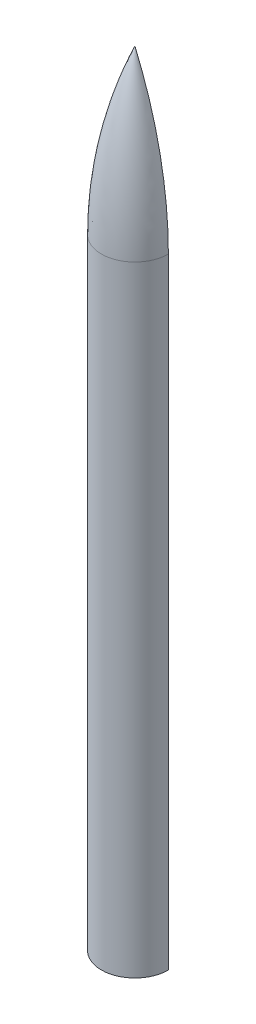
ISO-10303-21;
HEADER;
FILE_DESCRIPTION(('STEP AP214'),'2;1');
FILE_NAME('part.step','',(''),(''),'','','');
FILE_SCHEMA(('AUTOMOTIVE_DESIGN { 1 0 10303 214 1 1 1 1 }'));
ENDSEC;
DATA;
#1=APPLICATION_CONTEXT('core data for automotive mechanical design processes');
#2=APPLICATION_PROTOCOL_DEFINITION('international standard','automotive_design',2000,#1);
#3=PRODUCT_CONTEXT('',#1,'mechanical');
#4=PRODUCT('Part','Part','',(#3));
#5=PRODUCT_RELATED_PRODUCT_CATEGORY('part','',(#4));
#6=PRODUCT_DEFINITION_FORMATION('','',#4);
#7=PRODUCT_DEFINITION_CONTEXT('part definition',#1,'design');
#8=PRODUCT_DEFINITION('design','',#6,#7);
#9=PRODUCT_DEFINITION_SHAPE('','',#8);
#10=(LENGTH_UNIT() NAMED_UNIT(*) SI_UNIT(.MILLI.,.METRE.));
#11=(NAMED_UNIT(*) PLANE_ANGLE_UNIT() SI_UNIT($,.RADIAN.));
#12=(NAMED_UNIT(*) SI_UNIT($,.STERADIAN.) SOLID_ANGLE_UNIT());
#13=UNCERTAINTY_MEASURE_WITH_UNIT(LENGTH_MEASURE(1.E-05),#10,'distance_accuracy_value','');
#14=(GEOMETRIC_REPRESENTATION_CONTEXT(3) GLOBAL_UNCERTAINTY_ASSIGNED_CONTEXT((#13)) GLOBAL_UNIT_ASSIGNED_CONTEXT((#10,
#11,#12)) REPRESENTATION_CONTEXT('',''));
#15=CARTESIAN_POINT('',(0.,0.,0.));
#16=DIRECTION('',(0.,0.,1.));
#17=DIRECTION('',(1.,0.,0.));
#18=AXIS2_PLACEMENT_3D('',#15,#16,#17);
#19=CARTESIAN_POINT('',(0.,2540.,1565.60331851852));
#20=DIRECTION('',(-1.,0.,0.));
#21=DIRECTION('',(0.,0.,-1.));
#22=AXIS2_PLACEMENT_3D('',#19,#20,#21);
#23=CIRCLE('',#22,1702.76331851852);
#24=TRIMMED_CURVE('',#23,(PARAMETER_VALUE(-0.40412049809632)),
(PARAMETER_VALUE(0.40412049809632)),.T.,.PARAMETER.);
#25=CARTESIAN_POINT('',(0.,2540.,0.));
#26=DIRECTION('',(0.,-1.,0.));
#27=AXIS1_PLACEMENT('',#25,#26);
#28=SURFACE_OF_REVOLUTION('',#24,#27);
#29=CARTESIAN_POINT('',(1565.60331851852,2540.,0.));
#30=DIRECTION('',(0.,0.,1.));
#31=DIRECTION('',(-1.,0.,0.));
#32=AXIS2_PLACEMENT_3D('',#29,#30,#31);
#33=CIRCLE('',#32,1702.76331851852);
#34=CARTESIAN_POINT('',(0.,3209.544,0.));
#35=VERTEX_POINT('',#34);
#36=CARTESIAN_POINT('',(-137.16,2540.,0.));
#37=VERTEX_POINT('',#36);
#38=EDGE_CURVE('E48',#35,#37,#33,.T.);
#39=ORIENTED_EDGE('',*,*,#38,.T.);
#40=CARTESIAN_POINT('',(0.,2540.,0.));
#41=DIRECTION('',(0.,-1.,0.));
#42=DIRECTION('',(0.,0.,-1.));
#43=AXIS2_PLACEMENT_3D('',#40,#41,#42);
#44=CIRCLE('',#43,137.16);
#45=CARTESIAN_POINT('',(137.16,2540.,-9.57783160871448E-13));
#46=VERTEX_POINT('',#45);
#47=EDGE_CURVE('E82',#46,#37,#44,.T.);
#48=ORIENTED_EDGE('',*,*,#47,.F.);
#49=CARTESIAN_POINT('',(-1565.60331851852,2540.,1.09325495412766E-11));
#50=DIRECTION('',(0.,0.,-1.));
#51=DIRECTION('',(1.,0.,0.));
#52=AXIS2_PLACEMENT_3D('',#49,#50,#51);
#53=CIRCLE('',#52,1702.76331851852);
#54=EDGE_CURVE('E97',#35,#46,#53,.T.);
#55=ORIENTED_EDGE('',*,*,#54,.F.);
#56=EDGE_LOOP('',(#39,#48,#55));
#57=FACE_BOUND('',#56,.T.);
#58=ADVANCED_FACE('F33',(#57),#28,.T.);
#59=CARTESIAN_POINT('',(0.,2540.,1565.60331851852));
#60=DIRECTION('',(-1.,0.,0.));
#61=DIRECTION('',(0.,0.,-1.));
#62=AXIS2_PLACEMENT_3D('',#59,#60,#61);
#63=CIRCLE('',#62,1699.58831851852);
#64=TRIMMED_CURVE('',#63,(PARAMETER_VALUE(-0.399729743288239)),
(PARAMETER_VALUE(0.399729743288239)),.T.,.PARAMETER.);
#65=CARTESIAN_POINT('',(0.,2540.,0.));
#66=DIRECTION('',(0.,-1.,0.));
#67=AXIS1_PLACEMENT('',#65,#66);
#68=SURFACE_OF_REVOLUTION('',#64,#67);
#69=CARTESIAN_POINT('',(0.,2540.,0.));
#70=DIRECTION('',(0.,-1.,0.));
#71=DIRECTION('',(0.,0.,-1.));
#72=AXIS2_PLACEMENT_3D('',#69,#70,#71);
#73=CIRCLE('',#72,133.985);
#74=CARTESIAN_POINT('',(133.985,2540.,-9.35612254369796E-13));
#75=VERTEX_POINT('',#74);
#76=CARTESIAN_POINT('',(-133.985,2540.,0.));
#77=VERTEX_POINT('',#76);
#78=EDGE_CURVE('E11',#75,#77,#73,.T.);
#79=ORIENTED_EDGE('',*,*,#78,.T.);
#80=CARTESIAN_POINT('',(1565.60331851852,2540.,0.));
#81=DIRECTION('',(0.,0.,-1.));
#82=DIRECTION('',(-1.,0.,0.));
#83=AXIS2_PLACEMENT_3D('',#80,#81,#82);
#84=CIRCLE('',#83,1699.58831851852);
#85=CARTESIAN_POINT('',(0.,3201.4277749599,0.));
#86=VERTEX_POINT('',#85);
#87=EDGE_CURVE('E55',#77,#86,#84,.T.);
#88=ORIENTED_EDGE('',*,*,#87,.T.);
#89=CARTESIAN_POINT('',(-1565.60331851852,2540.,1.09325495412766E-11));
#90=DIRECTION('',(0.,0.,1.));
#91=DIRECTION('',(1.,0.,0.));
#92=AXIS2_PLACEMENT_3D('',#89,#90,#91);
#93=CIRCLE('',#92,1699.58831851852);
#94=EDGE_CURVE('E90',#75,#86,#93,.T.);
#95=ORIENTED_EDGE('',*,*,#94,.F.);
#96=EDGE_LOOP('',(#79,#88,#95));
#97=FACE_BOUND('',#96,.T.);
#98=ADVANCED_FACE('F35',(#97),#68,.F.);
#99=CARTESIAN_POINT('',(0.,0.,0.));
#100=DIRECTION('',(0.,-1.,0.));
#101=DIRECTION('',(0.,0.,-1.));
#102=AXIS2_PLACEMENT_3D('',#99,#100,#101);
#103=CYLINDRICAL_SURFACE('',#102,133.985);
#104=CARTESIAN_POINT('',(0.,0.,0.));
#105=DIRECTION('',(0.,-1.,0.));
#106=DIRECTION('',(0.,0.,-1.));
#107=AXIS2_PLACEMENT_3D('',#104,#105,#106);
#108=CIRCLE('',#107,133.985);
#109=CARTESIAN_POINT('',(133.985,0.,-9.35612254369794E-13));
#110=VERTEX_POINT('',#109);
#111=CARTESIAN_POINT('',(-133.985,0.,0.));
#112=VERTEX_POINT('',#111);
#113=EDGE_CURVE('E41',#110,#112,#108,.T.);
#114=ORIENTED_EDGE('',*,*,#113,.T.);
#115=DIRECTION('',(0.,1.,0.));
#116=VECTOR('',#115,1.);
#117=CARTESIAN_POINT('',(-133.985,0.,0.));
#118=LINE('',#117,#116);
#119=EDGE_CURVE('E101',#112,#77,#118,.T.);
#120=ORIENTED_EDGE('',*,*,#119,.T.);
#121=ORIENTED_EDGE('',*,*,#78,.F.);
#122=DIRECTION('',(0.,1.,0.));
#123=VECTOR('',#122,1.);
#124=CARTESIAN_POINT('',(133.985,0.,-9.35612254369794E-13));
#125=LINE('',#124,#123);
#126=EDGE_CURVE('E110',#110,#75,#125,.T.);
#127=ORIENTED_EDGE('',*,*,#126,.F.);
#128=EDGE_LOOP('',(#114,#120,#121,#127));
#129=FACE_BOUND('',#128,.T.);
#130=ADVANCED_FACE('F116',(#129),#103,.F.);
#131=CARTESIAN_POINT('',(137.16,0.,-9.57783160871448E-13));
#132=DIRECTION('',(0.,1.,0.));
#133=DIRECTION('',(0.,0.,1.));
#134=AXIS2_PLACEMENT_3D('',#131,#132,#133);
#135=PLANE('',#134);
#136=CARTESIAN_POINT('',(0.,0.,0.));
#137=DIRECTION('',(0.,-1.,0.));
#138=DIRECTION('',(0.,0.,-1.));
#139=AXIS2_PLACEMENT_3D('',#136,#137,#138);
#140=CIRCLE('',#139,137.16);
#141=CARTESIAN_POINT('',(137.16,0.,-9.57783160871448E-13));
#142=VERTEX_POINT('',#141);
#143=CARTESIAN_POINT('',(-137.16,0.,0.));
#144=VERTEX_POINT('',#143);
#145=EDGE_CURVE('E89',#142,#144,#140,.T.);
#146=ORIENTED_EDGE('',*,*,#145,.T.);
#147=DIRECTION('',(1.,0.,0.));
#148=VECTOR('',#147,1.);
#149=CARTESIAN_POINT('',(-137.16,0.,0.));
#150=LINE('',#149,#148);
#151=EDGE_CURVE('E95',#144,#112,#150,.T.);
#152=ORIENTED_EDGE('',*,*,#151,.T.);
#153=ORIENTED_EDGE('',*,*,#113,.F.);
#154=DIRECTION('',(-1.,0.,0.));
#155=VECTOR('',#154,1.);
#156=CARTESIAN_POINT('',(137.16,0.,-9.57783160871448E-13));
#157=LINE('',#156,#155);
#158=EDGE_CURVE('E107',#142,#110,#157,.T.);
#159=ORIENTED_EDGE('',*,*,#158,.F.);
#160=EDGE_LOOP('',(#146,#152,#153,#159));
#161=FACE_BOUND('',#160,.T.);
#162=ADVANCED_FACE('F119',(#161),#135,.F.);
#163=CARTESIAN_POINT('',(0.,0.,0.));
#164=DIRECTION('',(0.,-1.,0.));
#165=DIRECTION('',(0.,0.,-1.));
#166=AXIS2_PLACEMENT_3D('',#163,#164,#165);
#167=CYLINDRICAL_SURFACE('',#166,137.16);
#168=DIRECTION('',(0.,-1.,0.));
#169=VECTOR('',#168,1.);
#170=CARTESIAN_POINT('',(137.16,0.,-9.57783160871448E-13));
#171=LINE('',#170,#169);
#172=EDGE_CURVE('E87',#46,#142,#171,.T.);
#173=ORIENTED_EDGE('',*,*,#172,.F.);
#174=ORIENTED_EDGE('',*,*,#47,.T.);
#175=DIRECTION('',(0.,-1.,0.));
#176=VECTOR('',#175,1.);
#177=CARTESIAN_POINT('',(-137.16,0.,0.));
#178=LINE('',#177,#176);
#179=EDGE_CURVE('E84',#37,#144,#178,.T.);
#180=ORIENTED_EDGE('',*,*,#179,.T.);
#181=ORIENTED_EDGE('',*,*,#145,.F.);
#182=EDGE_LOOP('',(#173,#174,#180,#181));
#183=FACE_BOUND('',#182,.T.);
#184=ADVANCED_FACE('F83',(#183),#167,.T.);
#185=CARTESIAN_POINT('',(-1565.60331851852,2540.,1.09325495412766E-11));
#186=DIRECTION('',(0.,0.,1.));
#187=DIRECTION('',(1.,0.,0.));
#188=AXIS2_PLACEMENT_3D('',#185,#186,#187);
#189=PLANE('',#188);
#190=ORIENTED_EDGE('',*,*,#54,.T.);
#191=ORIENTED_EDGE('',*,*,#172,.T.);
#192=ORIENTED_EDGE('',*,*,#158,.T.);
#193=ORIENTED_EDGE('',*,*,#126,.T.);
#194=ORIENTED_EDGE('',*,*,#94,.T.);
#195=ORIENTED_EDGE('',*,*,#87,.F.);
#196=ORIENTED_EDGE('',*,*,#119,.F.);
#197=ORIENTED_EDGE('',*,*,#151,.F.);
#198=ORIENTED_EDGE('',*,*,#179,.F.);
#199=ORIENTED_EDGE('',*,*,#38,.F.);
#200=EDGE_LOOP('',(#190,#191,#192,#193,#194,#195,#196,#197,#198,#199));
#201=FACE_BOUND('',#200,.T.);
#202=ADVANCED_FACE('F92',(#201),#189,.F.);
#203=CLOSED_SHELL('',(#58,#98,#130,#162,#184,#202));
#204=MANIFOLD_SOLID_BREP('B2',#203);
#205=ADVANCED_BREP_SHAPE_REPRESENTATION('',(#18,#204),#14);
#206=SHAPE_DEFINITION_REPRESENTATION(#9,#205);
ENDSEC;
END-ISO-10303-21;
